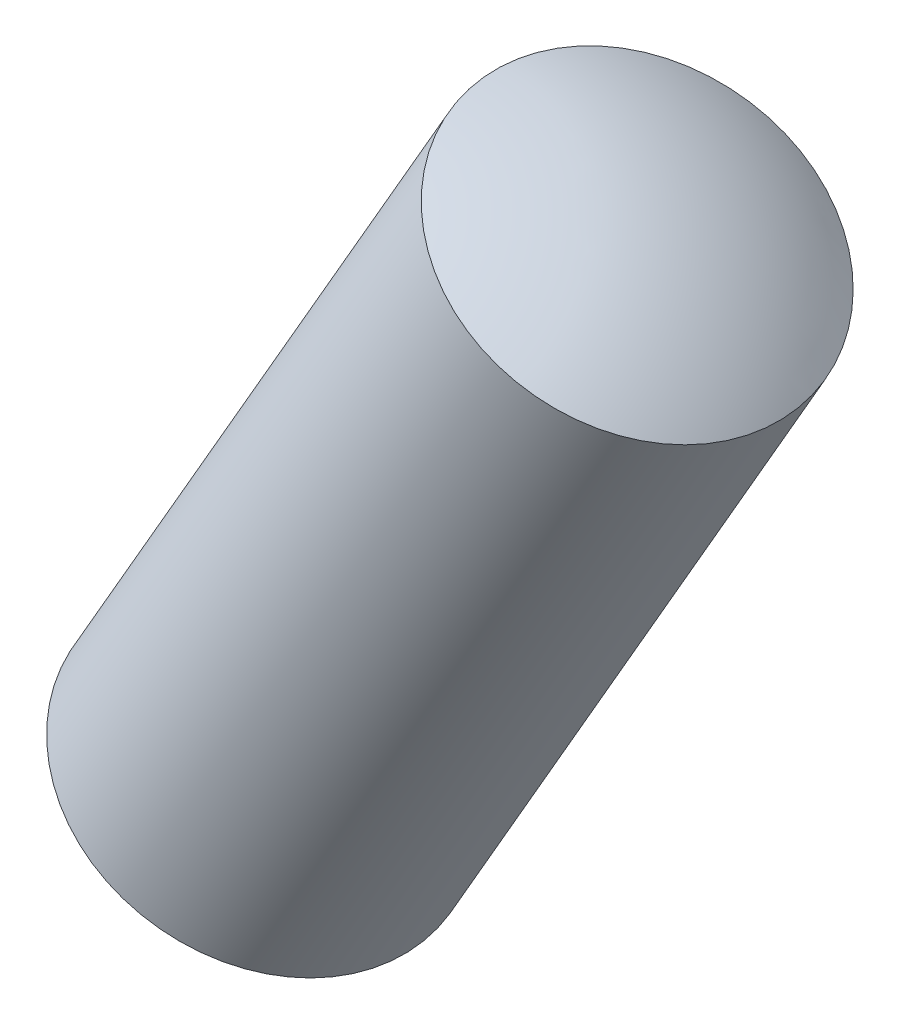
ISO-10303-21;
HEADER;
FILE_DESCRIPTION(('STEP AP214'),'2;1');
FILE_NAME('part.step','',(''),(''),'','','');
FILE_SCHEMA(('AUTOMOTIVE_DESIGN { 1 0 10303 214 1 1 1 1 }'));
ENDSEC;
DATA;
#1=APPLICATION_CONTEXT('core data for automotive mechanical design processes');
#2=APPLICATION_PROTOCOL_DEFINITION('international standard','automotive_design',2000,#1);
#3=PRODUCT_CONTEXT('',#1,'mechanical');
#4=PRODUCT('Part','Part','',(#3));
#5=PRODUCT_RELATED_PRODUCT_CATEGORY('part','',(#4));
#6=PRODUCT_DEFINITION_FORMATION('','',#4);
#7=PRODUCT_DEFINITION_CONTEXT('part definition',#1,'design');
#8=PRODUCT_DEFINITION('design','',#6,#7);
#9=PRODUCT_DEFINITION_SHAPE('','',#8);
#10=(LENGTH_UNIT() NAMED_UNIT(*) SI_UNIT(.MILLI.,.METRE.));
#11=(NAMED_UNIT(*) PLANE_ANGLE_UNIT() SI_UNIT($,.RADIAN.));
#12=(NAMED_UNIT(*) SI_UNIT($,.STERADIAN.) SOLID_ANGLE_UNIT());
#13=UNCERTAINTY_MEASURE_WITH_UNIT(LENGTH_MEASURE(1.E-05),#10,'distance_accuracy_value','');
#14=(GEOMETRIC_REPRESENTATION_CONTEXT(3) GLOBAL_UNCERTAINTY_ASSIGNED_CONTEXT((#13)) GLOBAL_UNIT_ASSIGNED_CONTEXT((#10,
#11,#12)) REPRESENTATION_CONTEXT('',''));
#15=CARTESIAN_POINT('',(0.,0.,0.));
#16=DIRECTION('',(0.,0.,1.));
#17=DIRECTION('',(1.,0.,0.));
#18=AXIS2_PLACEMENT_3D('',#15,#16,#17);
#19=CARTESIAN_POINT('',(-11.1539068568249,-19.3250630915733,0.599999999999989));
#20=DIRECTION('',(-0.866091834159181,0.499884921559739,0.));
#21=DIRECTION('',(-0.499884921559738,-0.866091834159182,0.));
#22=AXIS2_PLACEMENT_3D('',#19,#20,#21);
#23=SPHERICAL_SURFACE('',#22,2.);
#24=CARTESIAN_POINT('',(-11.1539068568249,-19.3250630915733,0.599999999999989));
#25=DIRECTION('',(0.499884921559738,0.866091834159181,0.));
#26=DIRECTION('',(0.,0.,-1.));
#27=AXIS2_PLACEMENT_3D('',#24,#25,#26);
#28=SPHERICAL_SURFACE('',#27,2.);
#29=CARTESIAN_POINT('',(-12.0197329389039,-20.8251781523575,0.599999999999989));
#30=DIRECTION('',(0.499884921559738,0.866091834159182,0.));
#31=DIRECTION('',(0.,0.,-1.));
#32=AXIS2_PLACEMENT_3D('',#29,#30,#31);
#33=CIRCLE('',#32,1.);
#34=CARTESIAN_POINT('',(-12.0197329389039,-20.8251781523575,-0.400000000000011));
#35=VERTEX_POINT('',#34);
#36=EDGE_CURVE('E11',#35,#35,#33,.T.);
#37=ORIENTED_EDGE('',*,*,#36,.F.);
#38=EDGE_LOOP('',(#37));
#39=FACE_BOUND('',#38,.T.);
#40=ADVANCED_FACE('F17',(#39),#28,.T.);
#41=CARTESIAN_POINT('',(-10.5910872310238,-18.3499316943511,0.6));
#42=DIRECTION('',(-0.866091834159181,0.499884921559739,0.));
#43=DIRECTION('',(0.499884921559738,0.866091834159182,0.));
#44=AXIS2_PLACEMENT_3D('',#41,#42,#43);
#45=SPHERICAL_SURFACE('',#44,2.);
#46=CARTESIAN_POINT('',(-10.5910872310238,-18.3499316943511,0.6));
#47=DIRECTION('',(0.499884921559738,0.866091834159181,0.));
#48=DIRECTION('',(0.,0.,-1.));
#49=AXIS2_PLACEMENT_3D('',#46,#47,#48);
#50=SPHERICAL_SURFACE('',#49,2.);
#51=CARTESIAN_POINT('',(-9.72526114894469,-16.8498166335669,0.599999999999989));
#52=DIRECTION('',(0.499884921559738,0.866091834159182,0.));
#53=DIRECTION('',(0.,0.,-1.));
#54=AXIS2_PLACEMENT_3D('',#51,#52,#53);
#55=CIRCLE('',#54,1.);
#56=CARTESIAN_POINT('',(-9.72526114894469,-16.8498166335669,-0.400000000000011));
#57=VERTEX_POINT('',#56);
#58=EDGE_CURVE('E20',#57,#57,#55,.T.);
#59=ORIENTED_EDGE('',*,*,#58,.T.);
#60=EDGE_LOOP('',(#59));
#61=FACE_BOUND('',#60,.T.);
#62=ADVANCED_FACE('F39',(#61),#50,.T.);
#63=CARTESIAN_POINT('',(-10.2988790964345,-17.8436570132645,0.6));
#64=DIRECTION('',(0.499884921559738,0.866091834159182,0.));
#65=DIRECTION('',(0.,0.,-1.));
#66=AXIS2_PLACEMENT_3D('',#63,#64,#65);
#67=CYLINDRICAL_SURFACE('',#66,1.);
#68=ORIENTED_EDGE('',*,*,#36,.T.);
#69=EDGE_LOOP('',(#68));
#70=FACE_BOUND('',#69,.T.);
#71=ORIENTED_EDGE('',*,*,#58,.F.);
#72=EDGE_LOOP('',(#71));
#73=FACE_BOUND('',#72,.T.);
#74=ADVANCED_FACE('F51',(#70,#73),#67,.T.);
#75=CLOSED_SHELL('',(#40,#62,#74));
#76=MANIFOLD_SOLID_BREP('B1',#75);
#77=ADVANCED_BREP_SHAPE_REPRESENTATION('',(#18,#76),#14);
#78=SHAPE_DEFINITION_REPRESENTATION(#9,#77);
ENDSEC;
END-ISO-10303-21;
